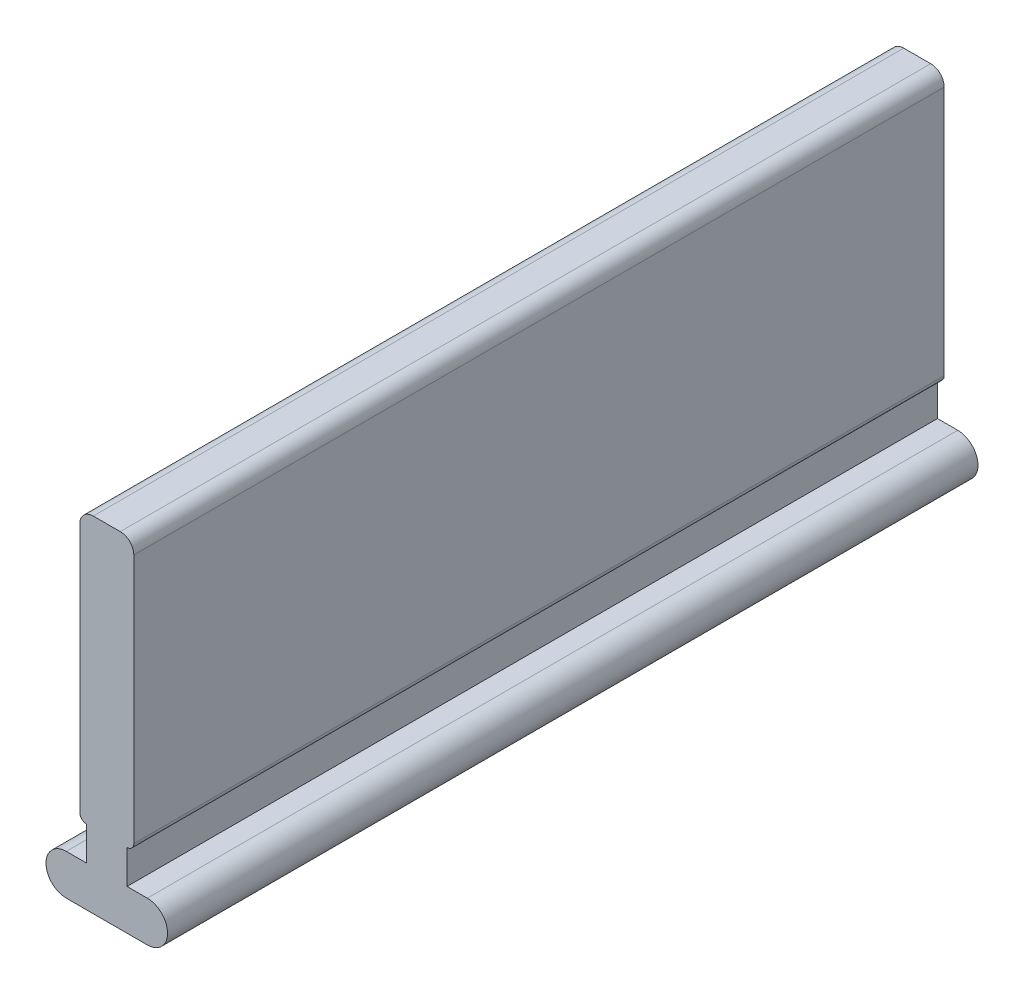
ISO-10303-21;
HEADER;
FILE_DESCRIPTION(('STEP AP214'),'2;1');
FILE_NAME('part.step','',(''),(''),'','','');
FILE_SCHEMA(('AUTOMOTIVE_DESIGN { 1 0 10303 214 1 1 1 1 }'));
ENDSEC;
DATA;
#1=APPLICATION_CONTEXT('core data for automotive mechanical design processes');
#2=APPLICATION_PROTOCOL_DEFINITION('international standard','automotive_design',2000,#1);
#3=PRODUCT_CONTEXT('',#1,'mechanical');
#4=PRODUCT('Part','Part','',(#3));
#5=PRODUCT_RELATED_PRODUCT_CATEGORY('part','',(#4));
#6=PRODUCT_DEFINITION_FORMATION('','',#4);
#7=PRODUCT_DEFINITION_CONTEXT('part definition',#1,'design');
#8=PRODUCT_DEFINITION('design','',#6,#7);
#9=PRODUCT_DEFINITION_SHAPE('','',#8);
#10=(LENGTH_UNIT() NAMED_UNIT(*) SI_UNIT(.MILLI.,.METRE.));
#11=(NAMED_UNIT(*) PLANE_ANGLE_UNIT() SI_UNIT($,.RADIAN.));
#12=(NAMED_UNIT(*) SI_UNIT($,.STERADIAN.) SOLID_ANGLE_UNIT());
#13=UNCERTAINTY_MEASURE_WITH_UNIT(LENGTH_MEASURE(1.E-05),#10,'distance_accuracy_value','');
#14=(GEOMETRIC_REPRESENTATION_CONTEXT(3) GLOBAL_UNCERTAINTY_ASSIGNED_CONTEXT((#13)) GLOBAL_UNIT_ASSIGNED_CONTEXT((#10,
#11,#12)) REPRESENTATION_CONTEXT('',''));
#15=CARTESIAN_POINT('',(0.,0.,0.));
#16=DIRECTION('',(0.,0.,1.));
#17=DIRECTION('',(1.,0.,0.));
#18=AXIS2_PLACEMENT_3D('',#15,#16,#17);
#19=CARTESIAN_POINT('',(1.5,3.5,60.));
#20=DIRECTION('',(0.,0.,-1.));
#21=DIRECTION('',(-1.,0.,0.));
#22=AXIS2_PLACEMENT_3D('',#19,#20,#21);
#23=CYLINDRICAL_SURFACE('',#22,0.5);
#24=DIRECTION('',(0.,0.,-1.));
#25=VECTOR('',#24,1.);
#26=CARTESIAN_POINT('',(2.,3.5,60.));
#27=LINE('',#26,#25);
#28=CARTESIAN_POINT('',(2.,3.5,60.));
#29=VERTEX_POINT('',#28);
#30=CARTESIAN_POINT('',(2.,3.5,0.));
#31=VERTEX_POINT('',#30);
#32=EDGE_CURVE('E147',#29,#31,#27,.T.);
#33=ORIENTED_EDGE('',*,*,#32,.F.);
#34=CARTESIAN_POINT('',(1.5,3.5,60.));
#35=DIRECTION('',(0.,0.,1.));
#36=DIRECTION('',(1.,0.,0.));
#37=AXIS2_PLACEMENT_3D('',#34,#35,#36);
#38=CIRCLE('',#37,0.5);
#39=CARTESIAN_POINT('',(1.5,3.,60.));
#40=VERTEX_POINT('',#39);
#41=EDGE_CURVE('E142',#40,#29,#38,.T.);
#42=ORIENTED_EDGE('',*,*,#41,.F.);
#43=DIRECTION('',(0.,0.,1.));
#44=VECTOR('',#43,1.);
#45=CARTESIAN_POINT('',(1.5,3.,-13.4164078649987));
#46=LINE('',#45,#44);
#47=CARTESIAN_POINT('',(1.5,3.,0.));
#48=VERTEX_POINT('',#47);
#49=EDGE_CURVE('E144',#48,#40,#46,.T.);
#50=ORIENTED_EDGE('',*,*,#49,.F.);
#51=CARTESIAN_POINT('',(1.5,3.5,0.));
#52=DIRECTION('',(0.,0.,1.));
#53=DIRECTION('',(1.,0.,0.));
#54=AXIS2_PLACEMENT_3D('',#51,#52,#53);
#55=CIRCLE('',#54,0.5);
#56=EDGE_CURVE('E150',#31,#48,#55,.F.);
#57=ORIENTED_EDGE('',*,*,#56,.F.);
#58=EDGE_LOOP('',(#33,#42,#50,#57));
#59=FACE_BOUND('',#58,.T.);
#60=ADVANCED_FACE('F39',(#59),#23,.T.);
#61=CARTESIAN_POINT('',(-1.5,3.5,60.));
#62=DIRECTION('',(0.,0.,1.));
#63=DIRECTION('',(1.,0.,0.));
#64=AXIS2_PLACEMENT_3D('',#61,#62,#63);
#65=CYLINDRICAL_SURFACE('',#64,0.5);
#66=DIRECTION('',(0.,0.,1.));
#67=VECTOR('',#66,1.);
#68=CARTESIAN_POINT('',(-2.,3.5,60.));
#69=LINE('',#68,#67);
#70=CARTESIAN_POINT('',(-2.,3.5,0.));
#71=VERTEX_POINT('',#70);
#72=CARTESIAN_POINT('',(-2.,3.5,60.));
#73=VERTEX_POINT('',#72);
#74=EDGE_CURVE('E208',#71,#73,#69,.T.);
#75=ORIENTED_EDGE('',*,*,#74,.F.);
#76=CARTESIAN_POINT('',(-1.5,3.5,0.));
#77=DIRECTION('',(0.,0.,1.));
#78=DIRECTION('',(1.,0.,0.));
#79=AXIS2_PLACEMENT_3D('',#76,#77,#78);
#80=CIRCLE('',#79,0.5);
#81=CARTESIAN_POINT('',(-1.5,3.,0.));
#82=VERTEX_POINT('',#81);
#83=EDGE_CURVE('E216',#82,#71,#80,.F.);
#84=ORIENTED_EDGE('',*,*,#83,.F.);
#85=DIRECTION('',(0.,0.,1.));
#86=VECTOR('',#85,1.);
#87=CARTESIAN_POINT('',(-1.5,3.,-13.4164078649987));
#88=LINE('',#87,#86);
#89=CARTESIAN_POINT('',(-1.5,3.,60.));
#90=VERTEX_POINT('',#89);
#91=EDGE_CURVE('E187',#82,#90,#88,.T.);
#92=ORIENTED_EDGE('',*,*,#91,.T.);
#93=CARTESIAN_POINT('',(-1.5,3.5,60.));
#94=DIRECTION('',(0.,0.,1.));
#95=DIRECTION('',(1.,0.,0.));
#96=AXIS2_PLACEMENT_3D('',#93,#94,#95);
#97=CIRCLE('',#96,0.5);
#98=EDGE_CURVE('E219',#73,#90,#97,.T.);
#99=ORIENTED_EDGE('',*,*,#98,.F.);
#100=EDGE_LOOP('',(#75,#84,#92,#99));
#101=FACE_BOUND('',#100,.T.);
#102=ADVANCED_FACE('F255',(#101),#65,.T.);
#103=CARTESIAN_POINT('',(2.,23.,60.));
#104=DIRECTION('',(-1.,0.,0.));
#105=DIRECTION('',(0.,-1.,0.));
#106=AXIS2_PLACEMENT_3D('',#103,#104,#105);
#107=PLANE('',#106);
#108=DIRECTION('',(0.,1.,0.));
#109=VECTOR('',#108,1.);
#110=CARTESIAN_POINT('',(2.,23.,0.));
#111=LINE('',#110,#109);
#112=CARTESIAN_POINT('',(2.,22.,0.));
#113=VERTEX_POINT('',#112);
#114=EDGE_CURVE('E209',#31,#113,#111,.T.);
#115=ORIENTED_EDGE('',*,*,#114,.T.);
#116=DIRECTION('',(0.,0.,-1.));
#117=VECTOR('',#116,1.);
#118=CARTESIAN_POINT('',(2.,22.,60.));
#119=LINE('',#118,#117);
#120=CARTESIAN_POINT('',(2.,22.,60.));
#121=VERTEX_POINT('',#120);
#122=EDGE_CURVE('E11',#113,#121,#119,.F.);
#123=ORIENTED_EDGE('',*,*,#122,.T.);
#124=DIRECTION('',(0.,1.,0.));
#125=VECTOR('',#124,1.);
#126=CARTESIAN_POINT('',(2.,23.,60.));
#127=LINE('',#126,#125);
#128=EDGE_CURVE('E201',#29,#121,#127,.T.);
#129=ORIENTED_EDGE('',*,*,#128,.F.);
#130=ORIENTED_EDGE('',*,*,#32,.T.);
#131=EDGE_LOOP('',(#115,#123,#129,#130));
#132=FACE_BOUND('',#131,.T.);
#133=ADVANCED_FACE('F253',(#132),#107,.F.);
#134=CARTESIAN_POINT('',(-2.,23.,60.));
#135=DIRECTION('',(0.,-1.,0.));
#136=DIRECTION('',(0.,0.,-1.));
#137=AXIS2_PLACEMENT_3D('',#134,#135,#136);
#138=PLANE('',#137);
#139=DIRECTION('',(-1.,0.,0.));
#140=VECTOR('',#139,1.);
#141=CARTESIAN_POINT('',(-2.,23.,0.));
#142=LINE('',#141,#140);
#143=CARTESIAN_POINT('',(0.999999999999997,23.,0.));
#144=VERTEX_POINT('',#143);
#145=CARTESIAN_POINT('',(-1.,23.,0.));
#146=VERTEX_POINT('',#145);
#147=EDGE_CURVE('E211',#144,#146,#142,.T.);
#148=ORIENTED_EDGE('',*,*,#147,.T.);
#149=DIRECTION('',(0.,0.,-1.));
#150=VECTOR('',#149,1.);
#151=CARTESIAN_POINT('',(-1.,23.,60.));
#152=LINE('',#151,#150);
#153=CARTESIAN_POINT('',(-1.,23.,60.));
#154=VERTEX_POINT('',#153);
#155=EDGE_CURVE('E60',#146,#154,#152,.F.);
#156=ORIENTED_EDGE('',*,*,#155,.T.);
#157=DIRECTION('',(-1.,0.,0.));
#158=VECTOR('',#157,1.);
#159=CARTESIAN_POINT('',(-2.,23.,60.));
#160=LINE('',#159,#158);
#161=CARTESIAN_POINT('',(0.999999999999997,23.,60.));
#162=VERTEX_POINT('',#161);
#163=EDGE_CURVE('E203',#162,#154,#160,.T.);
#164=ORIENTED_EDGE('',*,*,#163,.F.);
#165=DIRECTION('',(0.,0.,-1.));
#166=VECTOR('',#165,1.);
#167=CARTESIAN_POINT('',(0.999999999999997,23.,60.));
#168=LINE('',#167,#166);
#169=EDGE_CURVE('E230',#162,#144,#168,.T.);
#170=ORIENTED_EDGE('',*,*,#169,.T.);
#171=EDGE_LOOP('',(#148,#156,#164,#170));
#172=FACE_BOUND('',#171,.T.);
#173=ADVANCED_FACE('F248',(#172),#138,.F.);
#174=CARTESIAN_POINT('',(-2.,3.,60.));
#175=DIRECTION('',(1.,0.,0.));
#176=DIRECTION('',(0.,1.,0.));
#177=AXIS2_PLACEMENT_3D('',#174,#175,#176);
#178=PLANE('',#177);
#179=DIRECTION('',(0.,-1.,0.));
#180=VECTOR('',#179,1.);
#181=CARTESIAN_POINT('',(-2.,3.,60.));
#182=LINE('',#181,#180);
#183=CARTESIAN_POINT('',(-2.,22.,60.));
#184=VERTEX_POINT('',#183);
#185=EDGE_CURVE('E206',#184,#73,#182,.T.);
#186=ORIENTED_EDGE('',*,*,#185,.F.);
#187=DIRECTION('',(0.,0.,-1.));
#188=VECTOR('',#187,1.);
#189=CARTESIAN_POINT('',(-2.,22.,60.));
#190=LINE('',#189,#188);
#191=CARTESIAN_POINT('',(-2.,22.,0.));
#192=VERTEX_POINT('',#191);
#193=EDGE_CURVE('E223',#184,#192,#190,.T.);
#194=ORIENTED_EDGE('',*,*,#193,.T.);
#195=DIRECTION('',(0.,-1.,0.));
#196=VECTOR('',#195,1.);
#197=CARTESIAN_POINT('',(-2.,3.,0.));
#198=LINE('',#197,#196);
#199=EDGE_CURVE('E204',#192,#71,#198,.T.);
#200=ORIENTED_EDGE('',*,*,#199,.T.);
#201=ORIENTED_EDGE('',*,*,#74,.T.);
#202=EDGE_LOOP('',(#186,#194,#200,#201));
#203=FACE_BOUND('',#202,.T.);
#204=ADVANCED_FACE('F241',(#203),#178,.F.);
#205=CARTESIAN_POINT('',(0.,0.,60.));
#206=DIRECTION('',(0.,0.,1.));
#207=DIRECTION('',(1.,0.,0.));
#208=AXIS2_PLACEMENT_3D('',#205,#206,#207);
#209=PLANE('',#208);
#210=ORIENTED_EDGE('',*,*,#163,.T.);
#211=CARTESIAN_POINT('',(-1.,22.,60.));
#212=DIRECTION('',(0.,0.,1.));
#213=DIRECTION('',(1.,0.,0.));
#214=AXIS2_PLACEMENT_3D('',#211,#212,#213);
#215=CIRCLE('',#214,1.);
#216=EDGE_CURVE('E47',#154,#184,#215,.T.);
#217=ORIENTED_EDGE('',*,*,#216,.T.);
#218=ORIENTED_EDGE('',*,*,#185,.T.);
#219=ORIENTED_EDGE('',*,*,#98,.T.);
#220=DIRECTION('',(0.,1.,0.));
#221=VECTOR('',#220,1.);
#222=CARTESIAN_POINT('',(-1.5,3.,60.));
#223=LINE('',#222,#221);
#224=CARTESIAN_POINT('',(-1.5,0.5,60.));
#225=VERTEX_POINT('',#224);
#226=EDGE_CURVE('E161',#225,#90,#223,.T.);
#227=ORIENTED_EDGE('',*,*,#226,.F.);
#228=DIRECTION('',(1.,0.,0.));
#229=VECTOR('',#228,1.);
#230=CARTESIAN_POINT('',(-3.,0.500000000000001,60.));
#231=LINE('',#230,#229);
#232=CARTESIAN_POINT('',(-3.,0.500000000000001,60.));
#233=VERTEX_POINT('',#232);
#234=EDGE_CURVE('E182',#233,#225,#231,.T.);
#235=ORIENTED_EDGE('',*,*,#234,.F.);
#236=CARTESIAN_POINT('',(-3.,-0.999999999999999,60.));
#237=DIRECTION('',(0.,0.,-1.));
#238=DIRECTION('',(1.,0.,0.));
#239=AXIS2_PLACEMENT_3D('',#236,#237,#238);
#240=CIRCLE('',#239,1.5);
#241=CARTESIAN_POINT('',(-3.,-2.5,60.));
#242=VERTEX_POINT('',#241);
#243=EDGE_CURVE('E179',#242,#233,#240,.T.);
#244=ORIENTED_EDGE('',*,*,#243,.F.);
#245=DIRECTION('',(-1.,0.,0.));
#246=VECTOR('',#245,1.);
#247=CARTESIAN_POINT('',(-3.,-2.5,60.));
#248=LINE('',#247,#246);
#249=CARTESIAN_POINT('',(3.00000000000001,-2.5,60.));
#250=VERTEX_POINT('',#249);
#251=EDGE_CURVE('E176',#250,#242,#248,.T.);
#252=ORIENTED_EDGE('',*,*,#251,.F.);
#253=CARTESIAN_POINT('',(3.,-0.999999999999999,60.));
#254=DIRECTION('',(0.,0.,-1.));
#255=DIRECTION('',(1.,0.,0.));
#256=AXIS2_PLACEMENT_3D('',#253,#254,#255);
#257=CIRCLE('',#256,1.5);
#258=CARTESIAN_POINT('',(3.,0.499999999999999,60.));
#259=VERTEX_POINT('',#258);
#260=EDGE_CURVE('E168',#259,#250,#257,.T.);
#261=ORIENTED_EDGE('',*,*,#260,.F.);
#262=DIRECTION('',(1.,0.,0.));
#263=VECTOR('',#262,1.);
#264=CARTESIAN_POINT('',(1.5,0.499999999999999,60.));
#265=LINE('',#264,#263);
#266=CARTESIAN_POINT('',(1.5,0.499999999999999,60.));
#267=VERTEX_POINT('',#266);
#268=EDGE_CURVE('E166',#267,#259,#265,.T.);
#269=ORIENTED_EDGE('',*,*,#268,.F.);
#270=DIRECTION('',(0.,-1.,0.));
#271=VECTOR('',#270,1.);
#272=CARTESIAN_POINT('',(1.5,3.,60.));
#273=LINE('',#272,#271);
#274=EDGE_CURVE('E156',#40,#267,#273,.T.);
#275=ORIENTED_EDGE('',*,*,#274,.F.);
#276=ORIENTED_EDGE('',*,*,#41,.T.);
#277=ORIENTED_EDGE('',*,*,#128,.T.);
#278=CARTESIAN_POINT('',(0.999999999999997,22.,60.));
#279=DIRECTION('',(0.,0.,1.));
#280=DIRECTION('',(1.,0.,0.));
#281=AXIS2_PLACEMENT_3D('',#278,#279,#280);
#282=CIRCLE('',#281,1.);
#283=EDGE_CURVE('E234',#121,#162,#282,.T.);
#284=ORIENTED_EDGE('',*,*,#283,.T.);
#285=EDGE_LOOP('',(#210,#217,#218,#219,#227,#235,#244,#252,#261,#269,#275,#276,#277,#284));
#286=FACE_BOUND('',#285,.T.);
#287=ADVANCED_FACE('F163',(#286),#209,.T.);
#288=CARTESIAN_POINT('',(0.,0.,0.));
#289=DIRECTION('',(0.,0.,1.));
#290=DIRECTION('',(1.,0.,0.));
#291=AXIS2_PLACEMENT_3D('',#288,#289,#290);
#292=PLANE('',#291);
#293=ORIENTED_EDGE('',*,*,#199,.F.);
#294=CARTESIAN_POINT('',(-1.,22.,0.));
#295=DIRECTION('',(0.,0.,1.));
#296=DIRECTION('',(1.,0.,0.));
#297=AXIS2_PLACEMENT_3D('',#294,#295,#296);
#298=CIRCLE('',#297,1.);
#299=EDGE_CURVE('E228',#192,#146,#298,.F.);
#300=ORIENTED_EDGE('',*,*,#299,.T.);
#301=ORIENTED_EDGE('',*,*,#147,.F.);
#302=CARTESIAN_POINT('',(0.999999999999997,22.,0.));
#303=DIRECTION('',(0.,0.,1.));
#304=DIRECTION('',(1.,0.,0.));
#305=AXIS2_PLACEMENT_3D('',#302,#303,#304);
#306=CIRCLE('',#305,1.);
#307=EDGE_CURVE('E226',#144,#113,#306,.F.);
#308=ORIENTED_EDGE('',*,*,#307,.T.);
#309=ORIENTED_EDGE('',*,*,#114,.F.);
#310=ORIENTED_EDGE('',*,*,#56,.T.);
#311=DIRECTION('',(0.,1.,0.));
#312=VECTOR('',#311,1.);
#313=CARTESIAN_POINT('',(1.5,3.,0.));
#314=LINE('',#313,#312);
#315=CARTESIAN_POINT('',(1.5,0.499999999999999,0.));
#316=VERTEX_POINT('',#315);
#317=EDGE_CURVE('E159',#316,#48,#314,.T.);
#318=ORIENTED_EDGE('',*,*,#317,.F.);
#319=DIRECTION('',(-1.,0.,0.));
#320=VECTOR('',#319,1.);
#321=CARTESIAN_POINT('',(1.5,0.499999999999999,0.));
#322=LINE('',#321,#320);
#323=CARTESIAN_POINT('',(3.,0.499999999999999,0.));
#324=VERTEX_POINT('',#323);
#325=EDGE_CURVE('E401',#324,#316,#322,.T.);
#326=ORIENTED_EDGE('',*,*,#325,.F.);
#327=CARTESIAN_POINT('',(3.,-0.999999999999999,0.));
#328=DIRECTION('',(0.,0.,1.));
#329=DIRECTION('',(1.,0.,0.));
#330=AXIS2_PLACEMENT_3D('',#327,#328,#329);
#331=CIRCLE('',#330,1.5);
#332=CARTESIAN_POINT('',(3.00000000000001,-2.5,0.));
#333=VERTEX_POINT('',#332);
#334=EDGE_CURVE('E396',#333,#324,#331,.T.);
#335=ORIENTED_EDGE('',*,*,#334,.F.);
#336=DIRECTION('',(1.,0.,0.));
#337=VECTOR('',#336,1.);
#338=CARTESIAN_POINT('',(-3.,-2.5,0.));
#339=LINE('',#338,#337);
#340=CARTESIAN_POINT('',(-3.,-2.5,0.));
#341=VERTEX_POINT('',#340);
#342=EDGE_CURVE('E400',#341,#333,#339,.T.);
#343=ORIENTED_EDGE('',*,*,#342,.F.);
#344=CARTESIAN_POINT('',(-3.,-0.999999999999999,0.));
#345=DIRECTION('',(0.,0.,1.));
#346=DIRECTION('',(1.,0.,0.));
#347=AXIS2_PLACEMENT_3D('',#344,#345,#346);
#348=CIRCLE('',#347,1.5);
#349=CARTESIAN_POINT('',(-3.,0.500000000000001,0.));
#350=VERTEX_POINT('',#349);
#351=EDGE_CURVE('E407',#350,#341,#348,.T.);
#352=ORIENTED_EDGE('',*,*,#351,.F.);
#353=DIRECTION('',(-1.,0.,0.));
#354=VECTOR('',#353,1.);
#355=CARTESIAN_POINT('',(-3.,0.500000000000001,0.));
#356=LINE('',#355,#354);
#357=CARTESIAN_POINT('',(-1.5,0.5,0.));
#358=VERTEX_POINT('',#357);
#359=EDGE_CURVE('E408',#358,#350,#356,.T.);
#360=ORIENTED_EDGE('',*,*,#359,.F.);
#361=DIRECTION('',(0.,-1.,0.));
#362=VECTOR('',#361,1.);
#363=CARTESIAN_POINT('',(-1.5,3.,0.));
#364=LINE('',#363,#362);
#365=EDGE_CURVE('E171',#82,#358,#364,.T.);
#366=ORIENTED_EDGE('',*,*,#365,.F.);
#367=ORIENTED_EDGE('',*,*,#83,.T.);
#368=EDGE_LOOP('',(#293,#300,#301,#308,#309,#310,#318,#326,#335,#343,#352,#360,#366,#367));
#369=FACE_BOUND('',#368,.T.);
#370=ADVANCED_FACE('F247',(#369),#292,.F.);
#371=CARTESIAN_POINT('',(-1.5,3.,-13.4164078649987));
#372=DIRECTION('',(1.,0.,0.));
#373=DIRECTION('',(0.,1.,0.));
#374=AXIS2_PLACEMENT_3D('',#371,#372,#373);
#375=PLANE('',#374);
#376=ORIENTED_EDGE('',*,*,#365,.T.);
#377=DIRECTION('',(0.,0.,1.));
#378=VECTOR('',#377,1.);
#379=CARTESIAN_POINT('',(-1.5,0.5,-13.4164078649987));
#380=LINE('',#379,#378);
#381=EDGE_CURVE('E190',#358,#225,#380,.T.);
#382=ORIENTED_EDGE('',*,*,#381,.T.);
#383=ORIENTED_EDGE('',*,*,#226,.T.);
#384=ORIENTED_EDGE('',*,*,#91,.F.);
#385=EDGE_LOOP('',(#376,#382,#383,#384));
#386=FACE_BOUND('',#385,.T.);
#387=ADVANCED_FACE('F287',(#386),#375,.F.);
#388=CARTESIAN_POINT('',(-3.,0.500000000000001,-13.4164078649987));
#389=DIRECTION('',(0.,-1.,0.));
#390=DIRECTION('',(1.,0.,0.));
#391=AXIS2_PLACEMENT_3D('',#388,#389,#390);
#392=PLANE('',#391);
#393=ORIENTED_EDGE('',*,*,#359,.T.);
#394=DIRECTION('',(0.,0.,1.));
#395=VECTOR('',#394,1.);
#396=CARTESIAN_POINT('',(-3.,0.500000000000001,-13.4164078649987));
#397=LINE('',#396,#395);
#398=EDGE_CURVE('E192',#350,#233,#397,.T.);
#399=ORIENTED_EDGE('',*,*,#398,.T.);
#400=ORIENTED_EDGE('',*,*,#234,.T.);
#401=ORIENTED_EDGE('',*,*,#381,.F.);
#402=EDGE_LOOP('',(#393,#399,#400,#401));
#403=FACE_BOUND('',#402,.T.);
#404=ADVANCED_FACE('F307',(#403),#392,.F.);
#405=CARTESIAN_POINT('',(-3.,-0.999999999999999,-13.4164078649987));
#406=DIRECTION('',(0.,0.,1.));
#407=DIRECTION('',(1.,0.,0.));
#408=AXIS2_PLACEMENT_3D('',#405,#406,#407);
#409=CYLINDRICAL_SURFACE('',#408,1.5);
#410=ORIENTED_EDGE('',*,*,#351,.T.);
#411=DIRECTION('',(0.,0.,1.));
#412=VECTOR('',#411,1.);
#413=CARTESIAN_POINT('',(-3.,-2.5,-13.4164078649987));
#414=LINE('',#413,#412);
#415=EDGE_CURVE('E194',#341,#242,#414,.T.);
#416=ORIENTED_EDGE('',*,*,#415,.T.);
#417=ORIENTED_EDGE('',*,*,#243,.T.);
#418=ORIENTED_EDGE('',*,*,#398,.F.);
#419=EDGE_LOOP('',(#410,#416,#417,#418));
#420=FACE_BOUND('',#419,.T.);
#421=ADVANCED_FACE('F315',(#420),#409,.T.);
#422=CARTESIAN_POINT('',(-3.,-2.5,-13.4164078649987));
#423=DIRECTION('',(0.,1.,0.));
#424=DIRECTION('',(-1.,0.,0.));
#425=AXIS2_PLACEMENT_3D('',#422,#423,#424);
#426=PLANE('',#425);
#427=ORIENTED_EDGE('',*,*,#342,.T.);
#428=DIRECTION('',(0.,0.,1.));
#429=VECTOR('',#428,1.);
#430=CARTESIAN_POINT('',(3.00000000000001,-2.5,-13.4164078649987));
#431=LINE('',#430,#429);
#432=EDGE_CURVE('E196',#333,#250,#431,.T.);
#433=ORIENTED_EDGE('',*,*,#432,.T.);
#434=ORIENTED_EDGE('',*,*,#251,.T.);
#435=ORIENTED_EDGE('',*,*,#415,.F.);
#436=EDGE_LOOP('',(#427,#433,#434,#435));
#437=FACE_BOUND('',#436,.T.);
#438=ADVANCED_FACE('F323',(#437),#426,.F.);
#439=CARTESIAN_POINT('',(3.,-0.999999999999999,-13.4164078649987));
#440=DIRECTION('',(0.,0.,1.));
#441=DIRECTION('',(1.,0.,0.));
#442=AXIS2_PLACEMENT_3D('',#439,#440,#441);
#443=CYLINDRICAL_SURFACE('',#442,1.5);
#444=ORIENTED_EDGE('',*,*,#334,.T.);
#445=DIRECTION('',(0.,0.,1.));
#446=VECTOR('',#445,1.);
#447=CARTESIAN_POINT('',(3.,0.499999999999999,-13.4164078649987));
#448=LINE('',#447,#446);
#449=EDGE_CURVE('E198',#324,#259,#448,.T.);
#450=ORIENTED_EDGE('',*,*,#449,.T.);
#451=ORIENTED_EDGE('',*,*,#260,.T.);
#452=ORIENTED_EDGE('',*,*,#432,.F.);
#453=EDGE_LOOP('',(#444,#450,#451,#452));
#454=FACE_BOUND('',#453,.T.);
#455=ADVANCED_FACE('F278',(#454),#443,.T.);
#456=CARTESIAN_POINT('',(1.5,0.499999999999999,-13.4164078649987));
#457=DIRECTION('',(0.,-1.,0.));
#458=DIRECTION('',(1.,0.,0.));
#459=AXIS2_PLACEMENT_3D('',#456,#457,#458);
#460=PLANE('',#459);
#461=ORIENTED_EDGE('',*,*,#325,.T.);
#462=DIRECTION('',(0.,0.,1.));
#463=VECTOR('',#462,1.);
#464=CARTESIAN_POINT('',(1.5,0.499999999999999,-13.4164078649987));
#465=LINE('',#464,#463);
#466=EDGE_CURVE('E160',#316,#267,#465,.T.);
#467=ORIENTED_EDGE('',*,*,#466,.T.);
#468=ORIENTED_EDGE('',*,*,#268,.T.);
#469=ORIENTED_EDGE('',*,*,#449,.F.);
#470=EDGE_LOOP('',(#461,#467,#468,#469));
#471=FACE_BOUND('',#470,.T.);
#472=ADVANCED_FACE('F273',(#471),#460,.F.);
#473=CARTESIAN_POINT('',(1.5,3.,-13.4164078649987));
#474=DIRECTION('',(-1.,0.,0.));
#475=DIRECTION('',(0.,-1.,0.));
#476=AXIS2_PLACEMENT_3D('',#473,#474,#475);
#477=PLANE('',#476);
#478=ORIENTED_EDGE('',*,*,#317,.T.);
#479=ORIENTED_EDGE('',*,*,#49,.T.);
#480=ORIENTED_EDGE('',*,*,#274,.T.);
#481=ORIENTED_EDGE('',*,*,#466,.F.);
#482=EDGE_LOOP('',(#478,#479,#480,#481));
#483=FACE_BOUND('',#482,.T.);
#484=ADVANCED_FACE('F154',(#483),#477,.F.);
#485=CARTESIAN_POINT('',(-1.,22.,60.));
#486=DIRECTION('',(0.,0.,-1.));
#487=DIRECTION('',(-1.,0.,0.));
#488=AXIS2_PLACEMENT_3D('',#485,#486,#487);
#489=CYLINDRICAL_SURFACE('',#488,1.);
#490=ORIENTED_EDGE('',*,*,#216,.F.);
#491=ORIENTED_EDGE('',*,*,#155,.F.);
#492=ORIENTED_EDGE('',*,*,#299,.F.);
#493=ORIENTED_EDGE('',*,*,#193,.F.);
#494=EDGE_LOOP('',(#490,#491,#492,#493));
#495=FACE_BOUND('',#494,.T.);
#496=ADVANCED_FACE('F244',(#495),#489,.T.);
#497=CARTESIAN_POINT('',(0.999999999999997,22.,60.));
#498=DIRECTION('',(0.,0.,-1.));
#499=DIRECTION('',(-1.,0.,0.));
#500=AXIS2_PLACEMENT_3D('',#497,#498,#499);
#501=CYLINDRICAL_SURFACE('',#500,1.);
#502=ORIENTED_EDGE('',*,*,#283,.F.);
#503=ORIENTED_EDGE('',*,*,#122,.F.);
#504=ORIENTED_EDGE('',*,*,#307,.F.);
#505=ORIENTED_EDGE('',*,*,#169,.F.);
#506=EDGE_LOOP('',(#502,#503,#504,#505));
#507=FACE_BOUND('',#506,.T.);
#508=ADVANCED_FACE('F41',(#507),#501,.T.);
#509=CLOSED_SHELL('',(#60,#102,#133,#173,#204,#287,#370,#387,#404,#421,#438,#455,#472,#484,#496,#508));
#510=MANIFOLD_SOLID_BREP('B2',#509);
#511=ADVANCED_BREP_SHAPE_REPRESENTATION('',(#18,#510),#14);
#512=SHAPE_DEFINITION_REPRESENTATION(#9,#511);
ENDSEC;
END-ISO-10303-21;
